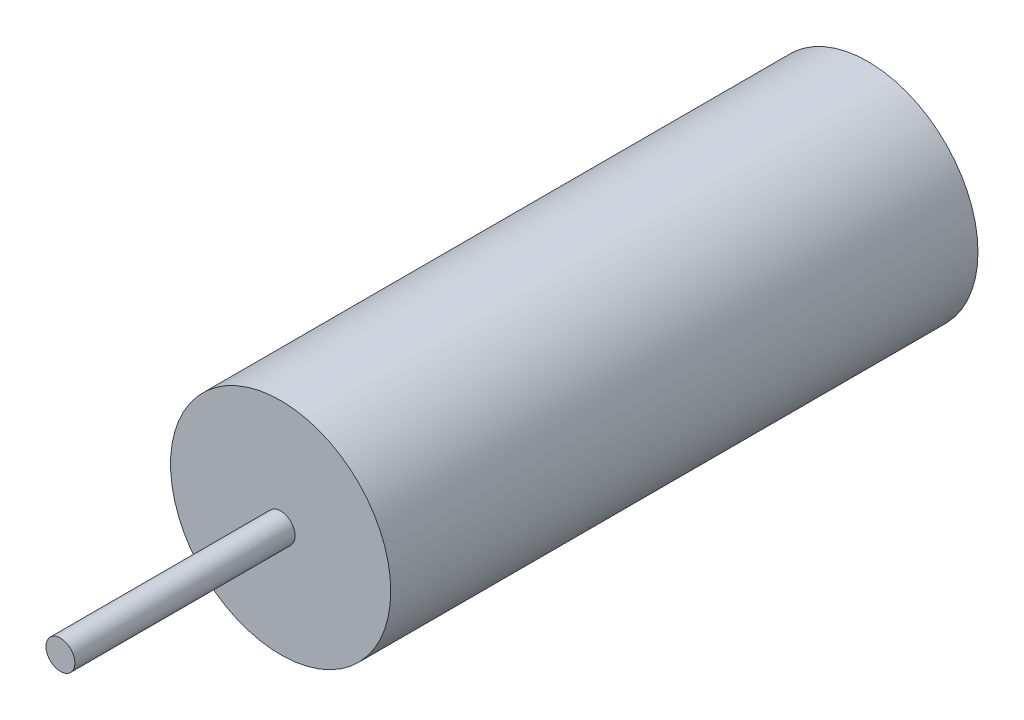
ISO-10303-21;
HEADER;
FILE_DESCRIPTION(('STEP AP214'),'2;1');
FILE_NAME('part.step','',(''),(''),'','','');
FILE_SCHEMA(('AUTOMOTIVE_DESIGN { 1 0 10303 214 1 1 1 1 }'));
ENDSEC;
DATA;
#1=APPLICATION_CONTEXT('core data for automotive mechanical design processes');
#2=APPLICATION_PROTOCOL_DEFINITION('international standard','automotive_design',2000,#1);
#3=PRODUCT_CONTEXT('',#1,'mechanical');
#4=PRODUCT('Part','Part','',(#3));
#5=PRODUCT_RELATED_PRODUCT_CATEGORY('part','',(#4));
#6=PRODUCT_DEFINITION_FORMATION('','',#4);
#7=PRODUCT_DEFINITION_CONTEXT('part definition',#1,'design');
#8=PRODUCT_DEFINITION('design','',#6,#7);
#9=PRODUCT_DEFINITION_SHAPE('','',#8);
#10=(LENGTH_UNIT() NAMED_UNIT(*) SI_UNIT(.MILLI.,.METRE.));
#11=(NAMED_UNIT(*) PLANE_ANGLE_UNIT() SI_UNIT($,.RADIAN.));
#12=(NAMED_UNIT(*) SI_UNIT($,.STERADIAN.) SOLID_ANGLE_UNIT());
#13=UNCERTAINTY_MEASURE_WITH_UNIT(LENGTH_MEASURE(1.E-05),#10,'distance_accuracy_value','');
#14=(GEOMETRIC_REPRESENTATION_CONTEXT(3) GLOBAL_UNCERTAINTY_ASSIGNED_CONTEXT((#13)) GLOBAL_UNIT_ASSIGNED_CONTEXT((#10,
#11,#12)) REPRESENTATION_CONTEXT('',''));
#15=CARTESIAN_POINT('',(0.,0.,0.));
#16=DIRECTION('',(0.,0.,1.));
#17=DIRECTION('',(1.,0.,0.));
#18=AXIS2_PLACEMENT_3D('',#15,#16,#17);
#19=CARTESIAN_POINT('',(0.,0.,101.6));
#20=DIRECTION('',(0.,0.,-1.));
#21=DIRECTION('',(-1.,0.,0.));
#22=AXIS2_PLACEMENT_3D('',#19,#20,#21);
#23=CYLINDRICAL_SURFACE('',#22,19.05);
#24=CARTESIAN_POINT('',(0.,0.,101.6));
#25=DIRECTION('',(0.,0.,1.));
#26=DIRECTION('',(1.,0.,0.));
#27=AXIS2_PLACEMENT_3D('',#24,#25,#26);
#28=CIRCLE('',#27,19.05);
#29=CARTESIAN_POINT('',(19.05,0.,101.6));
#30=VERTEX_POINT('',#29);
#31=EDGE_CURVE('E10',#30,#30,#28,.T.);
#32=ORIENTED_EDGE('',*,*,#31,.F.);
#33=EDGE_LOOP('',(#32));
#34=FACE_BOUND('',#33,.T.);
#35=CARTESIAN_POINT('',(0.,0.,0.));
#36=DIRECTION('',(0.,0.,1.));
#37=DIRECTION('',(1.,0.,0.));
#38=AXIS2_PLACEMENT_3D('',#35,#36,#37);
#39=CIRCLE('',#38,19.05);
#40=CARTESIAN_POINT('',(19.05,0.,0.));
#41=VERTEX_POINT('',#40);
#42=EDGE_CURVE('E37',#41,#41,#39,.T.);
#43=ORIENTED_EDGE('',*,*,#42,.T.);
#44=EDGE_LOOP('',(#43));
#45=FACE_BOUND('',#44,.T.);
#46=ADVANCED_FACE('F34',(#34,#45),#23,.T.);
#47=CARTESIAN_POINT('',(0.,0.,101.6));
#48=DIRECTION('',(0.,0.,1.));
#49=DIRECTION('',(1.,0.,0.));
#50=AXIS2_PLACEMENT_3D('',#47,#48,#49);
#51=PLANE('',#50);
#52=CARTESIAN_POINT('',(0.,0.,101.6));
#53=DIRECTION('',(0.,0.,1.));
#54=DIRECTION('',(1.,0.,0.));
#55=AXIS2_PLACEMENT_3D('',#52,#53,#54);
#56=CIRCLE('',#55,2.5);
#57=CARTESIAN_POINT('',(2.5,0.,101.6));
#58=VERTEX_POINT('',#57);
#59=EDGE_CURVE('E46',#58,#58,#56,.T.);
#60=ORIENTED_EDGE('',*,*,#59,.F.);
#61=EDGE_LOOP('',(#60));
#62=FACE_BOUND('',#61,.T.);
#63=ORIENTED_EDGE('',*,*,#31,.T.);
#64=EDGE_LOOP('',(#63));
#65=FACE_BOUND('',#64,.T.);
#66=ADVANCED_FACE('F61',(#62,#65),#51,.T.);
#67=CARTESIAN_POINT('',(0.,0.,0.));
#68=DIRECTION('',(0.,0.,1.));
#69=DIRECTION('',(1.,0.,0.));
#70=AXIS2_PLACEMENT_3D('',#67,#68,#69);
#71=PLANE('',#70);
#72=ORIENTED_EDGE('',*,*,#42,.F.);
#73=EDGE_LOOP('',(#72));
#74=FACE_BOUND('',#73,.T.);
#75=ADVANCED_FACE('F57',(#74),#71,.F.);
#76=CARTESIAN_POINT('',(0.,0.,139.7));
#77=DIRECTION('',(0.,0.,-1.));
#78=DIRECTION('',(-1.,0.,0.));
#79=AXIS2_PLACEMENT_3D('',#76,#77,#78);
#80=CYLINDRICAL_SURFACE('',#79,2.5);
#81=CARTESIAN_POINT('',(0.,0.,139.7));
#82=DIRECTION('',(0.,0.,1.));
#83=DIRECTION('',(1.,0.,0.));
#84=AXIS2_PLACEMENT_3D('',#81,#82,#83);
#85=CIRCLE('',#84,2.5);
#86=CARTESIAN_POINT('',(2.5,0.,139.7));
#87=VERTEX_POINT('',#86);
#88=EDGE_CURVE('E44',#87,#87,#85,.T.);
#89=ORIENTED_EDGE('',*,*,#88,.F.);
#90=EDGE_LOOP('',(#89));
#91=FACE_BOUND('',#90,.T.);
#92=ORIENTED_EDGE('',*,*,#59,.T.);
#93=EDGE_LOOP('',(#92));
#94=FACE_BOUND('',#93,.T.);
#95=ADVANCED_FACE('F54',(#91,#94),#80,.T.);
#96=CARTESIAN_POINT('',(0.,0.,139.7));
#97=DIRECTION('',(0.,0.,1.));
#98=DIRECTION('',(1.,0.,0.));
#99=AXIS2_PLACEMENT_3D('',#96,#97,#98);
#100=PLANE('',#99);
#101=ORIENTED_EDGE('',*,*,#88,.T.);
#102=EDGE_LOOP('',(#101));
#103=FACE_BOUND('',#102,.T.);
#104=ADVANCED_FACE('F52',(#103),#100,.T.);
#105=CLOSED_SHELL('',(#46,#66,#75,#95,#104));
#106=MANIFOLD_SOLID_BREP('B2',#105);
#107=ADVANCED_BREP_SHAPE_REPRESENTATION('',(#18,#106),#14);
#108=SHAPE_DEFINITION_REPRESENTATION(#9,#107);
ENDSEC;
END-ISO-10303-21;
